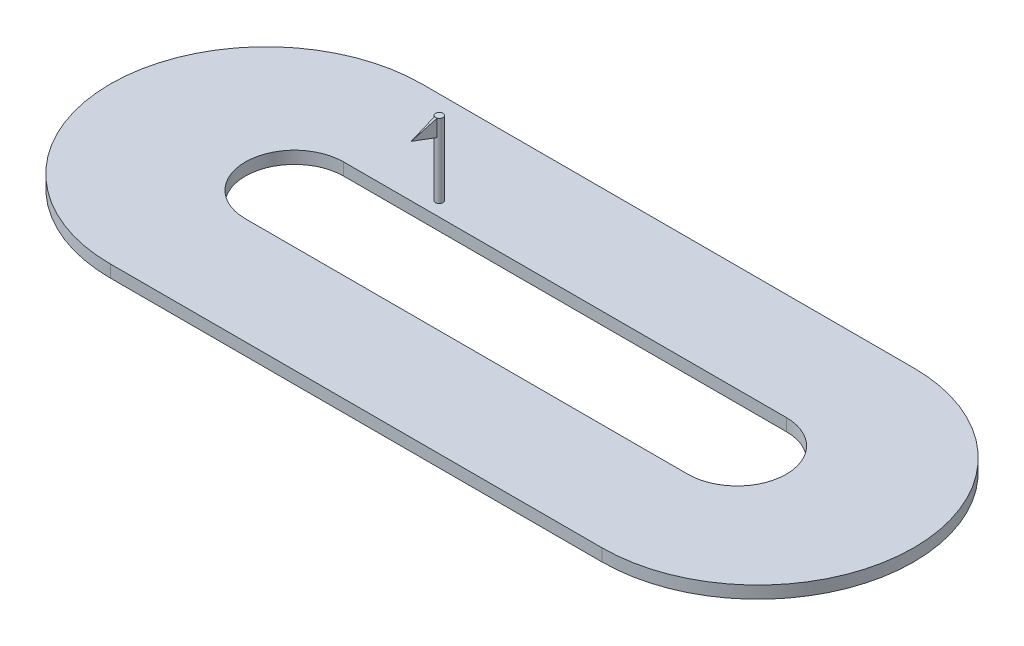
ISO-10303-21;
HEADER;
FILE_DESCRIPTION(('STEP AP214'),'2;1');
FILE_NAME('part.step','',(''),(''),'','','');
FILE_SCHEMA(('AUTOMOTIVE_DESIGN { 1 0 10303 214 1 1 1 1 }'));
ENDSEC;
DATA;
#1=APPLICATION_CONTEXT('core data for automotive mechanical design processes');
#2=APPLICATION_PROTOCOL_DEFINITION('international standard','automotive_design',2000,#1);
#3=PRODUCT_CONTEXT('',#1,'mechanical');
#4=PRODUCT('Part','Part','',(#3));
#5=PRODUCT_RELATED_PRODUCT_CATEGORY('part','',(#4));
#6=PRODUCT_DEFINITION_FORMATION('','',#4);
#7=PRODUCT_DEFINITION_CONTEXT('part definition',#1,'design');
#8=PRODUCT_DEFINITION('design','',#6,#7);
#9=PRODUCT_DEFINITION_SHAPE('','',#8);
#10=(LENGTH_UNIT() NAMED_UNIT(*) SI_UNIT(.MILLI.,.METRE.));
#11=(NAMED_UNIT(*) PLANE_ANGLE_UNIT() SI_UNIT($,.RADIAN.));
#12=(NAMED_UNIT(*) SI_UNIT($,.STERADIAN.) SOLID_ANGLE_UNIT());
#13=UNCERTAINTY_MEASURE_WITH_UNIT(LENGTH_MEASURE(1.E-05),#10,'distance_accuracy_value','');
#14=(GEOMETRIC_REPRESENTATION_CONTEXT(3) GLOBAL_UNCERTAINTY_ASSIGNED_CONTEXT((#13)) GLOBAL_UNIT_ASSIGNED_CONTEXT((#10,
#11,#12)) REPRESENTATION_CONTEXT('',''));
#15=CARTESIAN_POINT('',(0.,0.,0.));
#16=DIRECTION('',(0.,0.,1.));
#17=DIRECTION('',(1.,0.,0.));
#18=AXIS2_PLACEMENT_3D('',#15,#16,#17);
#19=CARTESIAN_POINT('',(-2186.38233519368,3500.,408.689063217764));
#20=DIRECTION('',(0.,-1.,0.));
#21=DIRECTION('',(0.,0.,-1.));
#22=AXIS2_PLACEMENT_3D('',#19,#20,#21);
#23=CYLINDRICAL_SURFACE('',#22,150.634589438444);
#24=CARTESIAN_POINT('',(-2186.38233519368,500.,408.689063217764));
#25=DIRECTION('',(0.,1.,0.));
#26=DIRECTION('',(0.,0.,1.));
#27=AXIS2_PLACEMENT_3D('',#24,#25,#26);
#28=CIRCLE('',#27,150.634589438444);
#29=CARTESIAN_POINT('',(-2186.38233519368,500.,559.323652656208));
#30=VERTEX_POINT('',#29);
#31=EDGE_CURVE('E198',#30,#30,#28,.T.);
#32=ORIENTED_EDGE('',*,*,#31,.T.);
#33=EDGE_LOOP('',(#32));
#34=FACE_BOUND('',#33,.T.);
#35=CARTESIAN_POINT('',(-2186.38233519368,2819.89046385257,408.689063217764));
#36=DIRECTION('',(0.,1.,0.));
#37=DIRECTION('',(0.,0.,1.));
#38=AXIS2_PLACEMENT_3D('',#35,#36,#37);
#39=CIRCLE('',#38,150.634589438444);
#40=CARTESIAN_POINT('',(-2186.38233519368,2819.89046385257,559.323652656208));
#41=VERTEX_POINT('',#40);
#42=CARTESIAN_POINT('',(-2132.20838770882,2819.89046385257,549.244970063388));
#43=VERTEX_POINT('',#42);
#44=EDGE_CURVE('E12',#41,#43,#39,.T.);
#45=ORIENTED_EDGE('',*,*,#44,.F.);
#46=CARTESIAN_POINT('',(-2236.45577830339,2819.89046385257,550.757461640594));
#47=VERTEX_POINT('',#46);
#48=EDGE_CURVE('E64',#47,#41,#39,.T.);
#49=ORIENTED_EDGE('',*,*,#48,.F.);
#50=DIRECTION('',(0.,-1.,0.));
#51=VECTOR('',#50,1.);
#52=CARTESIAN_POINT('',(-2236.45577830339,3500.,550.757461640594));
#53=LINE('',#52,#51);
#54=CARTESIAN_POINT('',(-2236.45577830339,3500.,550.757461640594));
#55=VERTEX_POINT('',#54);
#56=EDGE_CURVE('E196',#55,#47,#53,.T.);
#57=ORIENTED_EDGE('',*,*,#56,.F.);
#58=CARTESIAN_POINT('',(-2186.38233519368,3500.,408.689063217764));
#59=DIRECTION('',(0.,1.,0.));
#60=DIRECTION('',(0.,0.,1.));
#61=AXIS2_PLACEMENT_3D('',#58,#59,#60);
#62=CIRCLE('',#61,150.634589438444);
#63=CARTESIAN_POINT('',(-2132.20838770882,3500.,549.244970063388));
#64=VERTEX_POINT('',#63);
#65=EDGE_CURVE('E199',#64,#55,#62,.T.);
#66=ORIENTED_EDGE('',*,*,#65,.F.);
#67=DIRECTION('',(0.,-1.,0.));
#68=VECTOR('',#67,1.);
#69=CARTESIAN_POINT('',(-2132.20838770882,3500.,549.244970063388));
#70=LINE('',#69,#68);
#71=EDGE_CURVE('E75',#43,#64,#70,.F.);
#72=ORIENTED_EDGE('',*,*,#71,.F.);
#73=EDGE_LOOP('',(#45,#49,#57,#66,#72));
#74=FACE_BOUND('',#73,.T.);
#75=ADVANCED_FACE('F60',(#34,#74),#23,.T.);
#76=CARTESIAN_POINT('',(-6645.60085905861,500.,2991.64242992945));
#77=DIRECTION('',(0.,1.,0.));
#78=DIRECTION('',(0.,0.,1.));
#79=AXIS2_PLACEMENT_3D('',#76,#77,#78);
#80=PLANE('',#79);
#81=ORIENTED_EDGE('',*,*,#31,.F.);
#82=EDGE_LOOP('',(#81));
#83=FACE_BOUND('',#82,.T.);
#84=CARTESIAN_POINT('',(-6645.60085905861,500.,2991.64242992945));
#85=DIRECTION('',(0.,1.,0.));
#86=DIRECTION('',(0.,0.,1.));
#87=AXIS2_PLACEMENT_3D('',#84,#85,#86);
#88=CIRCLE('',#87,6336.95430070436);
#89=CARTESIAN_POINT('',(-6645.60085905861,500.,-3345.31187077491));
#90=VERTEX_POINT('',#89);
#91=CARTESIAN_POINT('',(-6645.60085905861,500.,9328.59673063382));
#92=VERTEX_POINT('',#91);
#93=EDGE_CURVE('E236',#90,#92,#88,.T.);
#94=ORIENTED_EDGE('',*,*,#93,.T.);
#95=DIRECTION('',(1.,0.,0.));
#96=VECTOR('',#95,1.);
#97=CARTESIAN_POINT('',(-6645.60085905861,500.,9328.59673063382));
#98=LINE('',#97,#96);
#99=CARTESIAN_POINT('',(13354.3991409414,500.,9328.59673063382));
#100=VERTEX_POINT('',#99);
#101=EDGE_CURVE('E239',#92,#100,#98,.T.);
#102=ORIENTED_EDGE('',*,*,#101,.T.);
#103=CARTESIAN_POINT('',(13354.3991409414,500.,2991.64242992945));
#104=DIRECTION('',(0.,1.,0.));
#105=DIRECTION('',(0.,0.,-1.));
#106=AXIS2_PLACEMENT_3D('',#103,#104,#105);
#107=CIRCLE('',#106,6336.95430070436);
#108=CARTESIAN_POINT('',(13354.3991409414,500.,-3345.31187077491));
#109=VERTEX_POINT('',#108);
#110=EDGE_CURVE('E242',#100,#109,#107,.T.);
#111=ORIENTED_EDGE('',*,*,#110,.T.);
#112=DIRECTION('',(-1.,0.,0.));
#113=VECTOR('',#112,1.);
#114=CARTESIAN_POINT('',(-6645.60085905861,500.,-3345.31187077491));
#115=LINE('',#114,#113);
#116=EDGE_CURVE('E244',#109,#90,#115,.T.);
#117=ORIENTED_EDGE('',*,*,#116,.T.);
#118=EDGE_LOOP('',(#94,#102,#111,#117));
#119=FACE_BOUND('',#118,.T.);
#120=DIRECTION('',(1.,0.,0.));
#121=VECTOR('',#120,1.);
#122=CARTESIAN_POINT('',(-5491.59431737794,500.,4991.64242992945));
#123=LINE('',#122,#121);
#124=CARTESIAN_POINT('',(-5491.59431737794,500.,4991.64242992945));
#125=VERTEX_POINT('',#124);
#126=CARTESIAN_POINT('',(12508.4056826221,500.,4991.64242992945));
#127=VERTEX_POINT('',#126);
#128=EDGE_CURVE('E207',#125,#127,#123,.T.);
#129=ORIENTED_EDGE('',*,*,#128,.F.);
#130=CARTESIAN_POINT('',(-5491.59431737794,500.,2991.64242992945));
#131=DIRECTION('',(0.,1.,0.));
#132=DIRECTION('',(0.,0.,-1.));
#133=AXIS2_PLACEMENT_3D('',#130,#131,#132);
#134=CIRCLE('',#133,2000.);
#135=CARTESIAN_POINT('',(-5491.59431737794,500.,991.642429929453));
#136=VERTEX_POINT('',#135);
#137=EDGE_CURVE('E205',#136,#125,#134,.T.);
#138=ORIENTED_EDGE('',*,*,#137,.F.);
#139=DIRECTION('',(-1.,0.,0.));
#140=VECTOR('',#139,1.);
#141=CARTESIAN_POINT('',(-5491.59431737794,500.,991.642429929453));
#142=LINE('',#141,#140);
#143=CARTESIAN_POINT('',(12508.4056826221,500.,991.642429929453));
#144=VERTEX_POINT('',#143);
#145=EDGE_CURVE('E213',#144,#136,#142,.T.);
#146=ORIENTED_EDGE('',*,*,#145,.F.);
#147=CARTESIAN_POINT('',(12508.4056826221,500.,2991.64242992945));
#148=DIRECTION('',(0.,1.,0.));
#149=DIRECTION('',(0.,0.,1.));
#150=AXIS2_PLACEMENT_3D('',#147,#148,#149);
#151=CIRCLE('',#150,2000.);
#152=EDGE_CURVE('E210',#127,#144,#151,.T.);
#153=ORIENTED_EDGE('',*,*,#152,.F.);
#154=EDGE_LOOP('',(#129,#138,#146,#153));
#155=FACE_BOUND('',#154,.T.);
#156=ADVANCED_FACE('F294',(#83,#119,#155),#80,.T.);
#157=CARTESIAN_POINT('',(-6645.60085905861,0.,2991.64242992945));
#158=DIRECTION('',(0.,1.,0.));
#159=DIRECTION('',(0.,0.,1.));
#160=AXIS2_PLACEMENT_3D('',#157,#158,#159);
#161=PLANE('',#160);
#162=CARTESIAN_POINT('',(-6645.60085905861,0.,2991.64242992945));
#163=DIRECTION('',(0.,1.,0.));
#164=DIRECTION('',(0.,0.,1.));
#165=AXIS2_PLACEMENT_3D('',#162,#163,#164);
#166=CIRCLE('',#165,6336.95430070436);
#167=CARTESIAN_POINT('',(-6645.60085905861,0.,-3345.31187077491));
#168=VERTEX_POINT('',#167);
#169=CARTESIAN_POINT('',(-6645.60085905861,0.,9328.59673063382));
#170=VERTEX_POINT('',#169);
#171=EDGE_CURVE('E235',#168,#170,#166,.T.);
#172=ORIENTED_EDGE('',*,*,#171,.F.);
#173=DIRECTION('',(-1.,0.,0.));
#174=VECTOR('',#173,1.);
#175=CARTESIAN_POINT('',(-6645.60085905861,0.,-3345.31187077491));
#176=LINE('',#175,#174);
#177=CARTESIAN_POINT('',(13354.3991409414,0.,-3345.31187077491));
#178=VERTEX_POINT('',#177);
#179=EDGE_CURVE('E240',#178,#168,#176,.T.);
#180=ORIENTED_EDGE('',*,*,#179,.F.);
#181=CARTESIAN_POINT('',(13354.3991409414,0.,2991.64242992945));
#182=DIRECTION('',(0.,1.,0.));
#183=DIRECTION('',(0.,0.,-1.));
#184=AXIS2_PLACEMENT_3D('',#181,#182,#183);
#185=CIRCLE('',#184,6336.95430070436);
#186=CARTESIAN_POINT('',(13354.3991409414,0.,9328.59673063382));
#187=VERTEX_POINT('',#186);
#188=EDGE_CURVE('E251',#187,#178,#185,.T.);
#189=ORIENTED_EDGE('',*,*,#188,.F.);
#190=DIRECTION('',(1.,0.,0.));
#191=VECTOR('',#190,1.);
#192=CARTESIAN_POINT('',(-6645.60085905861,0.,9328.59673063382));
#193=LINE('',#192,#191);
#194=EDGE_CURVE('E249',#170,#187,#193,.T.);
#195=ORIENTED_EDGE('',*,*,#194,.F.);
#196=EDGE_LOOP('',(#172,#180,#189,#195));
#197=FACE_BOUND('',#196,.T.);
#198=CARTESIAN_POINT('',(-5491.59431737794,0.,2991.64242992945));
#199=DIRECTION('',(0.,1.,0.));
#200=DIRECTION('',(0.,0.,-1.));
#201=AXIS2_PLACEMENT_3D('',#198,#199,#200);
#202=CIRCLE('',#201,2000.);
#203=CARTESIAN_POINT('',(-5491.59431737794,0.,991.642429929453));
#204=VERTEX_POINT('',#203);
#205=CARTESIAN_POINT('',(-5491.59431737794,0.,4991.64242992945));
#206=VERTEX_POINT('',#205);
#207=EDGE_CURVE('E202',#204,#206,#202,.T.);
#208=ORIENTED_EDGE('',*,*,#207,.T.);
#209=DIRECTION('',(1.,0.,0.));
#210=VECTOR('',#209,1.);
#211=CARTESIAN_POINT('',(-5491.59431737794,0.,4991.64242992945));
#212=LINE('',#211,#210);
#213=CARTESIAN_POINT('',(12508.4056826221,0.,4991.64242992945));
#214=VERTEX_POINT('',#213);
#215=EDGE_CURVE('E218',#206,#214,#212,.T.);
#216=ORIENTED_EDGE('',*,*,#215,.T.);
#217=CARTESIAN_POINT('',(12508.4056826221,0.,2991.64242992945));
#218=DIRECTION('',(0.,1.,0.));
#219=DIRECTION('',(0.,0.,1.));
#220=AXIS2_PLACEMENT_3D('',#217,#218,#219);
#221=CIRCLE('',#220,2000.);
#222=CARTESIAN_POINT('',(12508.4056826221,0.,991.642429929453));
#223=VERTEX_POINT('',#222);
#224=EDGE_CURVE('E221',#214,#223,#221,.T.);
#225=ORIENTED_EDGE('',*,*,#224,.T.);
#226=DIRECTION('',(-1.,0.,0.));
#227=VECTOR('',#226,1.);
#228=CARTESIAN_POINT('',(-5491.59431737794,0.,991.642429929453));
#229=LINE('',#228,#227);
#230=EDGE_CURVE('E208',#223,#204,#229,.T.);
#231=ORIENTED_EDGE('',*,*,#230,.T.);
#232=EDGE_LOOP('',(#208,#216,#225,#231));
#233=FACE_BOUND('',#232,.T.);
#234=ADVANCED_FACE('F300',(#197,#233),#161,.F.);
#235=CARTESIAN_POINT('',(-6645.60085905861,500.,2991.64242992945));
#236=DIRECTION('',(0.,-1.,0.));
#237=DIRECTION('',(0.,0.,-1.));
#238=AXIS2_PLACEMENT_3D('',#235,#236,#237);
#239=CYLINDRICAL_SURFACE('',#238,6336.95430070436);
#240=ORIENTED_EDGE('',*,*,#171,.T.);
#241=DIRECTION('',(0.,-1.,0.));
#242=VECTOR('',#241,1.);
#243=CARTESIAN_POINT('',(-6645.60085905861,500.,9328.59673063382));
#244=LINE('',#243,#242);
#245=EDGE_CURVE('E261',#92,#170,#244,.T.);
#246=ORIENTED_EDGE('',*,*,#245,.F.);
#247=ORIENTED_EDGE('',*,*,#93,.F.);
#248=DIRECTION('',(0.,-1.,0.));
#249=VECTOR('',#248,1.);
#250=CARTESIAN_POINT('',(-6645.60085905861,500.,-3345.31187077491));
#251=LINE('',#250,#249);
#252=EDGE_CURVE('E246',#90,#168,#251,.T.);
#253=ORIENTED_EDGE('',*,*,#252,.T.);
#254=EDGE_LOOP('',(#240,#246,#247,#253));
#255=FACE_BOUND('',#254,.T.);
#256=ADVANCED_FACE('F62',(#255),#239,.T.);
#257=CARTESIAN_POINT('',(-6645.60085905861,500.,9328.59673063382));
#258=DIRECTION('',(0.,0.,-1.));
#259=DIRECTION('',(-1.,0.,0.));
#260=AXIS2_PLACEMENT_3D('',#257,#258,#259);
#261=PLANE('',#260);
#262=ORIENTED_EDGE('',*,*,#194,.T.);
#263=DIRECTION('',(0.,-1.,0.));
#264=VECTOR('',#263,1.);
#265=CARTESIAN_POINT('',(13354.3991409414,500.,9328.59673063382));
#266=LINE('',#265,#264);
#267=EDGE_CURVE('E259',#100,#187,#266,.T.);
#268=ORIENTED_EDGE('',*,*,#267,.F.);
#269=ORIENTED_EDGE('',*,*,#101,.F.);
#270=ORIENTED_EDGE('',*,*,#245,.T.);
#271=EDGE_LOOP('',(#262,#268,#269,#270));
#272=FACE_BOUND('',#271,.T.);
#273=ADVANCED_FACE('F330',(#272),#261,.F.);
#274=CARTESIAN_POINT('',(13354.3991409414,500.,2991.64242992945));
#275=DIRECTION('',(0.,-1.,0.));
#276=DIRECTION('',(0.,0.,-1.));
#277=AXIS2_PLACEMENT_3D('',#274,#275,#276);
#278=CYLINDRICAL_SURFACE('',#277,6336.95430070436);
#279=ORIENTED_EDGE('',*,*,#188,.T.);
#280=DIRECTION('',(0.,-1.,0.));
#281=VECTOR('',#280,1.);
#282=CARTESIAN_POINT('',(13354.3991409414,500.,-3345.31187077491));
#283=LINE('',#282,#281);
#284=EDGE_CURVE('E256',#109,#178,#283,.T.);
#285=ORIENTED_EDGE('',*,*,#284,.F.);
#286=ORIENTED_EDGE('',*,*,#110,.F.);
#287=ORIENTED_EDGE('',*,*,#267,.T.);
#288=EDGE_LOOP('',(#279,#285,#286,#287));
#289=FACE_BOUND('',#288,.T.);
#290=ADVANCED_FACE('F327',(#289),#278,.T.);
#291=CARTESIAN_POINT('',(-6645.60085905861,500.,-3345.31187077491));
#292=DIRECTION('',(0.,0.,1.));
#293=DIRECTION('',(1.,0.,0.));
#294=AXIS2_PLACEMENT_3D('',#291,#292,#293);
#295=PLANE('',#294);
#296=ORIENTED_EDGE('',*,*,#179,.T.);
#297=ORIENTED_EDGE('',*,*,#252,.F.);
#298=ORIENTED_EDGE('',*,*,#116,.F.);
#299=ORIENTED_EDGE('',*,*,#284,.T.);
#300=EDGE_LOOP('',(#296,#297,#298,#299));
#301=FACE_BOUND('',#300,.T.);
#302=ADVANCED_FACE('F319',(#301),#295,.F.);
#303=CARTESIAN_POINT('',(-5491.59431737794,500.,2991.64242992945));
#304=DIRECTION('',(0.,-1.,0.));
#305=DIRECTION('',(0.,0.,-1.));
#306=AXIS2_PLACEMENT_3D('',#303,#304,#305);
#307=CYLINDRICAL_SURFACE('',#306,2000.);
#308=ORIENTED_EDGE('',*,*,#207,.F.);
#309=DIRECTION('',(0.,-1.,0.));
#310=VECTOR('',#309,1.);
#311=CARTESIAN_POINT('',(-5491.59431737794,500.,991.642429929453));
#312=LINE('',#311,#310);
#313=EDGE_CURVE('E215',#136,#204,#312,.T.);
#314=ORIENTED_EDGE('',*,*,#313,.F.);
#315=ORIENTED_EDGE('',*,*,#137,.T.);
#316=DIRECTION('',(0.,-1.,0.));
#317=VECTOR('',#316,1.);
#318=CARTESIAN_POINT('',(-5491.59431737794,500.,4991.64242992945));
#319=LINE('',#318,#317);
#320=EDGE_CURVE('E232',#125,#206,#319,.T.);
#321=ORIENTED_EDGE('',*,*,#320,.T.);
#322=EDGE_LOOP('',(#308,#314,#315,#321));
#323=FACE_BOUND('',#322,.T.);
#324=ADVANCED_FACE('F316',(#323),#307,.F.);
#325=CARTESIAN_POINT('',(-5491.59431737794,500.,4991.64242992945));
#326=DIRECTION('',(0.,0.,-1.));
#327=DIRECTION('',(-1.,0.,0.));
#328=AXIS2_PLACEMENT_3D('',#325,#326,#327);
#329=PLANE('',#328);
#330=ORIENTED_EDGE('',*,*,#215,.F.);
#331=ORIENTED_EDGE('',*,*,#320,.F.);
#332=ORIENTED_EDGE('',*,*,#128,.T.);
#333=DIRECTION('',(0.,-1.,0.));
#334=VECTOR('',#333,1.);
#335=CARTESIAN_POINT('',(12508.4056826221,500.,4991.64242992945));
#336=LINE('',#335,#334);
#337=EDGE_CURVE('E230',#127,#214,#336,.T.);
#338=ORIENTED_EDGE('',*,*,#337,.T.);
#339=EDGE_LOOP('',(#330,#331,#332,#338));
#340=FACE_BOUND('',#339,.T.);
#341=ADVANCED_FACE('F312',(#340),#329,.T.);
#342=CARTESIAN_POINT('',(12508.4056826221,500.,2991.64242992945));
#343=DIRECTION('',(0.,-1.,0.));
#344=DIRECTION('',(0.,0.,-1.));
#345=AXIS2_PLACEMENT_3D('',#342,#343,#344);
#346=CYLINDRICAL_SURFACE('',#345,2000.);
#347=ORIENTED_EDGE('',*,*,#224,.F.);
#348=ORIENTED_EDGE('',*,*,#337,.F.);
#349=ORIENTED_EDGE('',*,*,#152,.T.);
#350=DIRECTION('',(0.,-1.,0.));
#351=VECTOR('',#350,1.);
#352=CARTESIAN_POINT('',(12508.4056826221,500.,991.642429929453));
#353=LINE('',#352,#351);
#354=EDGE_CURVE('E228',#144,#223,#353,.T.);
#355=ORIENTED_EDGE('',*,*,#354,.T.);
#356=EDGE_LOOP('',(#347,#348,#349,#355));
#357=FACE_BOUND('',#356,.T.);
#358=ADVANCED_FACE('F308',(#357),#346,.F.);
#359=CARTESIAN_POINT('',(-5491.59431737794,500.,991.642429929453));
#360=DIRECTION('',(0.,0.,1.));
#361=DIRECTION('',(1.,0.,0.));
#362=AXIS2_PLACEMENT_3D('',#359,#360,#361);
#363=PLANE('',#362);
#364=ORIENTED_EDGE('',*,*,#230,.F.);
#365=ORIENTED_EDGE('',*,*,#354,.F.);
#366=ORIENTED_EDGE('',*,*,#145,.T.);
#367=ORIENTED_EDGE('',*,*,#313,.T.);
#368=EDGE_LOOP('',(#364,#365,#366,#367));
#369=FACE_BOUND('',#368,.T.);
#370=ADVANCED_FACE('F305',(#369),#363,.T.);
#371=CARTESIAN_POINT('',(-2186.38233519368,3500.,408.689063217764));
#372=DIRECTION('',(0.,1.,0.));
#373=DIRECTION('',(0.,0.,1.));
#374=AXIS2_PLACEMENT_3D('',#371,#372,#373);
#375=PLANE('',#374);
#376=DIRECTION('',(0.,0.,1.));
#377=VECTOR('',#376,1.);
#378=CARTESIAN_POINT('',(-2236.45577830339,3500.,509.323652656208));
#379=LINE('',#378,#377);
#380=CARTESIAN_POINT('',(-2236.45577830339,3500.,559.323652656208));
#381=VERTEX_POINT('',#380);
#382=EDGE_CURVE('E189',#55,#381,#379,.T.);
#383=ORIENTED_EDGE('',*,*,#382,.T.);
#384=DIRECTION('',(1.,0.,0.));
#385=VECTOR('',#384,1.);
#386=CARTESIAN_POINT('',(-2236.45577830339,3500.,559.323652656208));
#387=LINE('',#386,#385);
#388=CARTESIAN_POINT('',(-2132.20838770882,3500.,559.323652656208));
#389=VERTEX_POINT('',#388);
#390=EDGE_CURVE('E183',#381,#389,#387,.T.);
#391=ORIENTED_EDGE('',*,*,#390,.T.);
#392=DIRECTION('',(0.,0.,1.));
#393=VECTOR('',#392,1.);
#394=CARTESIAN_POINT('',(-2132.20838770882,3500.,509.323652656208));
#395=LINE('',#394,#393);
#396=EDGE_CURVE('E178',#64,#389,#395,.T.);
#397=ORIENTED_EDGE('',*,*,#396,.F.);
#398=ORIENTED_EDGE('',*,*,#65,.T.);
#399=EDGE_LOOP('',(#383,#391,#397,#398));
#400=FACE_BOUND('',#399,.T.);
#401=ADVANCED_FACE('F273',(#400),#375,.T.);
#402=CARTESIAN_POINT('',(-2132.20838770882,2819.89046385257,509.323652656208));
#403=DIRECTION('',(0.,1.,0.));
#404=DIRECTION('',(0.,0.,1.));
#405=AXIS2_PLACEMENT_3D('',#402,#403,#404);
#406=PLANE('',#405);
#407=DIRECTION('',(-1.,0.,0.));
#408=VECTOR('',#407,1.);
#409=CARTESIAN_POINT('',(-2132.20838770882,2819.89046385257,559.323652656208));
#410=LINE('',#409,#408);
#411=CARTESIAN_POINT('',(-2132.20838770882,2819.89046385257,559.323652656208));
#412=VERTEX_POINT('',#411);
#413=EDGE_CURVE('E152',#412,#41,#410,.T.);
#414=ORIENTED_EDGE('',*,*,#413,.T.);
#415=ORIENTED_EDGE('',*,*,#44,.T.);
#416=DIRECTION('',(0.,0.,1.));
#417=VECTOR('',#416,1.);
#418=CARTESIAN_POINT('',(-2132.20838770882,2819.89046385257,509.323652656208));
#419=LINE('',#418,#417);
#420=EDGE_CURVE('E175',#43,#412,#419,.T.);
#421=ORIENTED_EDGE('',*,*,#420,.T.);
#422=EDGE_LOOP('',(#414,#415,#421));
#423=FACE_BOUND('',#422,.T.);
#424=ADVANCED_FACE('F176',(#423),#406,.F.);
#425=CARTESIAN_POINT('',(-2236.45577830339,2819.89046385257,509.323652656208));
#426=DIRECTION('',(1.,0.,0.));
#427=DIRECTION('',(0.,0.,-1.));
#428=AXIS2_PLACEMENT_3D('',#425,#426,#427);
#429=PLANE('',#428);
#430=ORIENTED_EDGE('',*,*,#382,.F.);
#431=ORIENTED_EDGE('',*,*,#56,.T.);
#432=DIRECTION('',(0.,0.,1.));
#433=VECTOR('',#432,1.);
#434=CARTESIAN_POINT('',(-2236.45577830339,2819.89046385257,509.323652656208));
#435=LINE('',#434,#433);
#436=CARTESIAN_POINT('',(-2236.45577830339,2819.89046385257,559.323652656208));
#437=VERTEX_POINT('',#436);
#438=EDGE_CURVE('E192',#47,#437,#435,.T.);
#439=ORIENTED_EDGE('',*,*,#438,.T.);
#440=DIRECTION('',(0.,1.,0.));
#441=VECTOR('',#440,1.);
#442=CARTESIAN_POINT('',(-2236.45577830339,2819.89046385257,559.323652656208));
#443=LINE('',#442,#441);
#444=EDGE_CURVE('E162',#437,#381,#443,.T.);
#445=ORIENTED_EDGE('',*,*,#444,.T.);
#446=EDGE_LOOP('',(#430,#431,#439,#445));
#447=FACE_BOUND('',#446,.T.);
#448=ADVANCED_FACE('F271',(#447),#429,.F.);
#449=CARTESIAN_POINT('',(-2132.20838770882,3500.,509.323652656208));
#450=DIRECTION('',(-1.,0.,0.));
#451=DIRECTION('',(0.,0.,1.));
#452=AXIS2_PLACEMENT_3D('',#449,#450,#451);
#453=PLANE('',#452);
#454=ORIENTED_EDGE('',*,*,#420,.F.);
#455=ORIENTED_EDGE('',*,*,#71,.T.);
#456=ORIENTED_EDGE('',*,*,#396,.T.);
#457=DIRECTION('',(0.,-1.,0.));
#458=VECTOR('',#457,1.);
#459=CARTESIAN_POINT('',(-2132.20838770882,3500.,559.323652656208));
#460=LINE('',#459,#458);
#461=EDGE_CURVE('E169',#389,#412,#460,.T.);
#462=ORIENTED_EDGE('',*,*,#461,.T.);
#463=EDGE_LOOP('',(#454,#455,#456,#462));
#464=FACE_BOUND('',#463,.T.);
#465=ADVANCED_FACE('F180',(#464),#453,.F.);
#466=ORIENTED_EDGE('',*,*,#438,.F.);
#467=ORIENTED_EDGE('',*,*,#48,.T.);
#468=EDGE_CURVE('E159',#41,#437,#410,.T.);
#469=ORIENTED_EDGE('',*,*,#468,.T.);
#470=EDGE_LOOP('',(#466,#467,#469));
#471=FACE_BOUND('',#470,.T.);
#472=ADVANCED_FACE('F267',(#471),#406,.F.);
#473=CARTESIAN_POINT('',(-2236.45577830339,3500.,559.323652656208));
#474=DIRECTION('',(-0.998629534754574,0.,0.052335956242944));
#475=DIRECTION('',(0.052335956242944,0.,0.998629534754574));
#476=AXIS2_PLACEMENT_3D('',#473,#474,#475);
#477=PLANE('',#476);
#478=ORIENTED_EDGE('',*,*,#444,.F.);
#479=DIRECTION('',(-0.0495284859891472,-0.323123633503386,-0.945059811095146));
#480=VECTOR('',#479,1.);
#481=CARTESIAN_POINT('',(-2225.5714247449,2890.89994051866,767.009490663193));
#482=LINE('',#481,#480);
#483=CARTESIAN_POINT('',(-2184.3320830061,3159.94523192629,1553.90300729317));
#484=VERTEX_POINT('',#483);
#485=EDGE_CURVE('E172',#437,#484,#482,.F.);
#486=ORIENTED_EDGE('',*,*,#485,.T.);
#487=DIRECTION('',(0.0495284859891472,-0.323123633503386,0.945059811095146));
#488=VECTOR('',#487,1.);
#489=CARTESIAN_POINT('',(-2236.45577830339,3500.,559.323652656208));
#490=LINE('',#489,#488);
#491=EDGE_CURVE('E278',#484,#381,#490,.F.);
#492=ORIENTED_EDGE('',*,*,#491,.T.);
#493=EDGE_LOOP('',(#478,#486,#492));
#494=FACE_BOUND('',#493,.T.);
#495=ADVANCED_FACE('F280',(#494),#477,.T.);
#496=CARTESIAN_POINT('',(-2132.20838770882,3500.,559.323652656208));
#497=DIRECTION('',(0.998629534754574,0.,0.052335956242944));
#498=DIRECTION('',(0.052335956242944,0.,-0.998629534754574));
#499=AXIS2_PLACEMENT_3D('',#496,#497,#498);
#500=PLANE('',#499);
#501=DIRECTION('',(0.0495284859891472,0.323123633503386,-0.945059811095146));
#502=VECTOR('',#501,1.);
#503=CARTESIAN_POINT('',(-2132.20838770882,3500.,559.323652656208));
#504=LINE('',#503,#502);
#505=EDGE_CURVE('E171',#389,#484,#504,.F.);
#506=ORIENTED_EDGE('',*,*,#505,.T.);
#507=DIRECTION('',(-0.0495284859891472,0.323123633503386,0.945059811095146));
#508=VECTOR('',#507,1.);
#509=CARTESIAN_POINT('',(-2143.0927412673,2890.89994051866,767.009490663193));
#510=LINE('',#509,#508);
#511=EDGE_CURVE('E156',#484,#412,#510,.F.);
#512=ORIENTED_EDGE('',*,*,#511,.T.);
#513=ORIENTED_EDGE('',*,*,#461,.F.);
#514=EDGE_LOOP('',(#506,#512,#513));
#515=FACE_BOUND('',#514,.T.);
#516=ADVANCED_FACE('F167',(#515),#500,.T.);
#517=CARTESIAN_POINT('',(-3035.74774575524,3304.89160907855,1129.96931254841));
#518=DIRECTION('',(0.,-0.946221097442967,-0.32352068674789));
#519=DIRECTION('',(0.,0.32352068674789,-0.946221097442967));
#520=AXIS2_PLACEMENT_3D('',#517,#518,#519);
#521=PLANE('',#520);
#522=ORIENTED_EDGE('',*,*,#505,.F.);
#523=ORIENTED_EDGE('',*,*,#390,.F.);
#524=ORIENTED_EDGE('',*,*,#491,.F.);
#525=EDGE_LOOP('',(#522,#523,#524));
#526=FACE_BOUND('',#525,.T.);
#527=ADVANCED_FACE('F277',(#526),#521,.F.);
#528=CARTESIAN_POINT('',(-3035.74774575524,2353.52350780024,-804.68882333997));
#529=DIRECTION('',(0.,0.946221097442968,-0.32352068674789));
#530=DIRECTION('',(0.,0.32352068674789,0.946221097442968));
#531=AXIS2_PLACEMENT_3D('',#528,#529,#530);
#532=PLANE('',#531);
#533=ORIENTED_EDGE('',*,*,#468,.F.);
#534=ORIENTED_EDGE('',*,*,#413,.F.);
#535=ORIENTED_EDGE('',*,*,#511,.F.);
#536=ORIENTED_EDGE('',*,*,#485,.F.);
#537=EDGE_LOOP('',(#533,#534,#535,#536));
#538=FACE_BOUND('',#537,.T.);
#539=ADVANCED_FACE('F154',(#538),#532,.F.);
#540=CLOSED_SHELL('',(#75,#156,#234,#256,#273,#290,#302,#324,#341,#358,#370,#401,#424,#448,#465,
#472,#495,#516,#527,#539));
#541=MANIFOLD_SOLID_BREP('B2',#540);
#542=ADVANCED_BREP_SHAPE_REPRESENTATION('',(#18,#541),#14);
#543=SHAPE_DEFINITION_REPRESENTATION(#9,#542);
ENDSEC;
END-ISO-10303-21;
